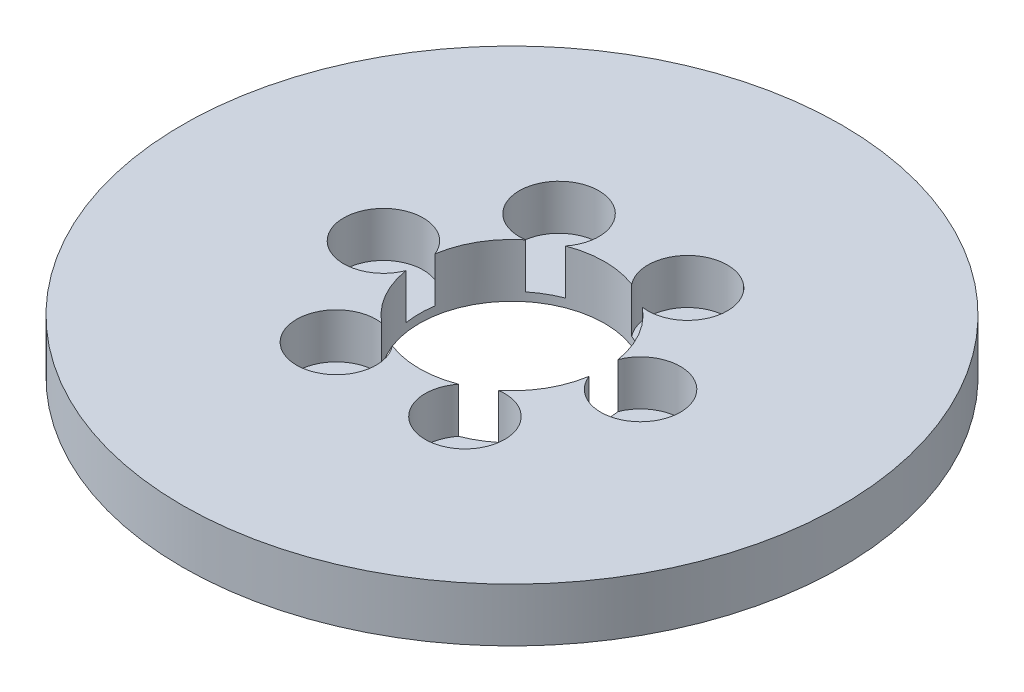
ISO-10303-21;
HEADER;
FILE_DESCRIPTION(('STEP AP214'),'2;1');
FILE_NAME('part.step','',(''),(''),'','','');
FILE_SCHEMA(('AUTOMOTIVE_DESIGN { 1 0 10303 214 1 1 1 1 }'));
ENDSEC;
DATA;
#1=APPLICATION_CONTEXT('core data for automotive mechanical design processes');
#2=APPLICATION_PROTOCOL_DEFINITION('international standard','automotive_design',2000,#1);
#3=PRODUCT_CONTEXT('',#1,'mechanical');
#4=PRODUCT('Part','Part','',(#3));
#5=PRODUCT_RELATED_PRODUCT_CATEGORY('part','',(#4));
#6=PRODUCT_DEFINITION_FORMATION('','',#4);
#7=PRODUCT_DEFINITION_CONTEXT('part definition',#1,'design');
#8=PRODUCT_DEFINITION('design','',#6,#7);
#9=PRODUCT_DEFINITION_SHAPE('','',#8);
#10=(LENGTH_UNIT() NAMED_UNIT(*) SI_UNIT(.MILLI.,.METRE.));
#11=(NAMED_UNIT(*) PLANE_ANGLE_UNIT() SI_UNIT($,.RADIAN.));
#12=(NAMED_UNIT(*) SI_UNIT($,.STERADIAN.) SOLID_ANGLE_UNIT());
#13=UNCERTAINTY_MEASURE_WITH_UNIT(LENGTH_MEASURE(1.E-05),#10,'distance_accuracy_value','');
#14=(GEOMETRIC_REPRESENTATION_CONTEXT(3) GLOBAL_UNCERTAINTY_ASSIGNED_CONTEXT((#13)) GLOBAL_UNIT_ASSIGNED_CONTEXT((#10,
#11,#12)) REPRESENTATION_CONTEXT('',''));
#15=CARTESIAN_POINT('',(0.,0.,0.));
#16=DIRECTION('',(0.,0.,1.));
#17=DIRECTION('',(1.,0.,0.));
#18=AXIS2_PLACEMENT_3D('',#15,#16,#17);
#19=CARTESIAN_POINT('',(0.,13.,0.));
#20=DIRECTION('',(0.,-1.,0.));
#21=DIRECTION('',(0.,0.,-1.));
#22=AXIS2_PLACEMENT_3D('',#19,#20,#21);
#23=CYLINDRICAL_SURFACE('',#22,80.);
#24=CARTESIAN_POINT('',(0.,13.,0.));
#25=DIRECTION('',(0.,1.,0.));
#26=DIRECTION('',(0.,0.,1.));
#27=AXIS2_PLACEMENT_3D('',#24,#25,#26);
#28=CIRCLE('',#27,80.);
#29=CARTESIAN_POINT('',(0.,13.,-80.));
#30=VERTEX_POINT('',#29);
#31=EDGE_CURVE('E171',#30,#30,#28,.T.);
#32=CARTESIAN_POINT('',(0.,0.,0.));
#33=DIRECTION('',(0.,1.,0.));
#34=DIRECTION('',(0.,0.,1.));
#35=AXIS2_PLACEMENT_3D('',#32,#33,#34);
#36=CIRCLE('',#35,80.);
#37=CARTESIAN_POINT('',(0.,0.,-80.));
#38=VERTEX_POINT('',#37);
#39=EDGE_CURVE('E157',#38,#38,#36,.T.);
#40=CARTESIAN_POINT('',(0.,13.,-80.));
#41=CARTESIAN_POINT('',(0.,12.8645833333333,-80.));
#42=CARTESIAN_POINT('',(0.,12.7291666666667,-80.));
#43=CARTESIAN_POINT('',(0.,12.4583333333333,-80.));
#44=CARTESIAN_POINT('',(0.,12.3229166666667,-80.));
#45=CARTESIAN_POINT('',(0.,12.0520833333333,-80.));
#46=CARTESIAN_POINT('',(0.,11.9166666666667,-80.));
#47=CARTESIAN_POINT('',(0.,11.6458333333333,-80.));
#48=CARTESIAN_POINT('',(0.,11.5104166666667,-80.));
#49=CARTESIAN_POINT('',(0.,11.2395833333333,-80.));
#50=CARTESIAN_POINT('',(0.,11.1041666666667,-80.));
#51=CARTESIAN_POINT('',(0.,10.8333333333333,-80.));
#52=CARTESIAN_POINT('',(0.,10.6979166666667,-80.));
#53=CARTESIAN_POINT('',(0.,10.4270833333333,-80.));
#54=CARTESIAN_POINT('',(0.,10.2916666666667,-80.));
#55=CARTESIAN_POINT('',(0.,10.0208333333333,-80.));
#56=CARTESIAN_POINT('',(0.,9.88541666666667,-80.));
#57=CARTESIAN_POINT('',(0.,9.61458333333333,-80.));
#58=CARTESIAN_POINT('',(0.,9.47916666666667,-80.));
#59=CARTESIAN_POINT('',(0.,9.20833333333333,-80.));
#60=CARTESIAN_POINT('',(0.,9.07291666666667,-80.));
#61=CARTESIAN_POINT('',(0.,8.80208333333333,-80.));
#62=CARTESIAN_POINT('',(0.,8.66666666666667,-80.));
#63=CARTESIAN_POINT('',(0.,8.39583333333333,-80.));
#64=CARTESIAN_POINT('',(0.,8.26041666666667,-80.));
#65=CARTESIAN_POINT('',(0.,7.98958333333333,-80.));
#66=CARTESIAN_POINT('',(0.,7.85416666666667,-80.));
#67=CARTESIAN_POINT('',(0.,7.58333333333333,-80.));
#68=CARTESIAN_POINT('',(0.,7.44791666666667,-80.));
#69=CARTESIAN_POINT('',(0.,7.17708333333333,-80.));
#70=CARTESIAN_POINT('',(0.,7.04166666666667,-80.));
#71=CARTESIAN_POINT('',(0.,6.77083333333333,-80.));
#72=CARTESIAN_POINT('',(0.,6.63541666666667,-80.));
#73=CARTESIAN_POINT('',(0.,6.36458333333333,-80.));
#74=CARTESIAN_POINT('',(0.,6.22916666666667,-80.));
#75=CARTESIAN_POINT('',(0.,5.95833333333333,-80.));
#76=CARTESIAN_POINT('',(0.,5.82291666666667,-80.));
#77=CARTESIAN_POINT('',(0.,5.55208333333333,-80.));
#78=CARTESIAN_POINT('',(0.,5.41666666666667,-80.));
#79=CARTESIAN_POINT('',(0.,5.14583333333333,-80.));
#80=CARTESIAN_POINT('',(0.,5.01041666666667,-80.));
#81=CARTESIAN_POINT('',(0.,4.73958333333333,-80.));
#82=CARTESIAN_POINT('',(0.,4.60416666666667,-80.));
#83=CARTESIAN_POINT('',(0.,4.33333333333333,-80.));
#84=CARTESIAN_POINT('',(0.,4.19791666666667,-80.));
#85=CARTESIAN_POINT('',(0.,3.92708333333333,-80.));
#86=CARTESIAN_POINT('',(0.,3.79166666666667,-80.));
#87=CARTESIAN_POINT('',(0.,3.52083333333333,-80.));
#88=CARTESIAN_POINT('',(0.,3.38541666666667,-80.));
#89=CARTESIAN_POINT('',(0.,3.11458333333333,-80.));
#90=CARTESIAN_POINT('',(0.,2.97916666666667,-80.));
#91=CARTESIAN_POINT('',(0.,2.70833333333333,-80.));
#92=CARTESIAN_POINT('',(0.,2.57291666666667,-80.));
#93=CARTESIAN_POINT('',(0.,2.30208333333333,-80.));
#94=CARTESIAN_POINT('',(0.,2.16666666666667,-80.));
#95=CARTESIAN_POINT('',(0.,1.89583333333333,-80.));
#96=CARTESIAN_POINT('',(0.,1.76041666666667,-80.));
#97=CARTESIAN_POINT('',(0.,1.48958333333333,-80.));
#98=CARTESIAN_POINT('',(0.,1.35416666666667,-80.));
#99=CARTESIAN_POINT('',(0.,1.08333333333333,-80.));
#100=CARTESIAN_POINT('',(0.,0.947916666666667,-80.));
#101=CARTESIAN_POINT('',(0.,0.677083333333334,-80.));
#102=CARTESIAN_POINT('',(0.,0.541666666666667,-80.));
#103=CARTESIAN_POINT('',(0.,0.270833333333334,-80.));
#104=CARTESIAN_POINT('',(0.,0.135416666666667,-80.));
#105=CARTESIAN_POINT('',(0.,0.,-80.));
#106=B_SPLINE_CURVE_WITH_KNOTS('',3,(#40,#41,#42,#43,#44,#45,#46,#47,#48,#49,#50,#51,#52,#53,
#54,#55,#56,#57,#58,#59,#60,#61,#62,#63,#64,#65,#66,#67,#68,#69,#70,#71,#72,#73,#74,#75,#76,#77,
#78,#79,#80,#81,#82,#83,#84,#85,#86,#87,#88,#89,#90,#91,#92,#93,#94,#95,#96,#97,#98,#99,#100,
#101,#102,#103,#104,#105),.UNSPECIFIED.,.F.,.F.,(4,2,2,2,2,2,2,2,2,2,2,2,2,2,2,2,2,2,2,2,2,2,2,
2,2,2,2,2,2,2,2,2,4),(0.,0.406249999999999,0.812499999999999,1.21875,1.625,2.03125,2.4375,
2.84375,3.25,3.65625,4.0625,4.46875,4.875,5.28125,5.6875,6.09375,6.5,6.90625,7.3125,7.71875,
8.125,8.53125,8.9375,9.34375,9.75,10.15625,10.5625,10.96875,11.375,11.78125,12.1875,12.59375,
13.),.UNSPECIFIED.);
#107=EDGE_CURVE('BSEAM39',#30,#38,#106,.T.);
#108=ORIENTED_EDGE('',*,*,#31,.F.);
#109=ORIENTED_EDGE('',*,*,#39,.T.);
#110=ORIENTED_EDGE('',*,*,#107,.T.);
#111=ORIENTED_EDGE('',*,*,#107,.F.);
#112=EDGE_LOOP('',(#108,#110,#109,#111));
#113=FACE_BOUND('',#112,.T.);
#114=ADVANCED_FACE('F39',(#113),#23,.T.);
#115=CARTESIAN_POINT('',(0.,13.,0.));
#116=DIRECTION('',(0.,1.,0.));
#117=DIRECTION('',(0.,0.,1.));
#118=AXIS2_PLACEMENT_3D('',#115,#116,#117);
#119=PLANE('',#118);
#120=CARTESIAN_POINT('',(-15.6050501604377,13.,-27.0287397325383));
#121=DIRECTION('',(0.,1.,0.));
#122=DIRECTION('',(-0.866025403784433,0.,0.50000000000001));
#123=AXIS2_PLACEMENT_3D('',#120,#121,#122);
#124=CIRCLE('',#123,9.65803549164258);
#125=CARTESIAN_POINT('',(-8.05176378163707,13.,-21.0099762019075));
#126=VERTEX_POINT('',#125);
#127=CARTESIAN_POINT('',(-14.1692912329402,13.,-17.4780200811226));
#128=VERTEX_POINT('',#127);
#129=EDGE_CURVE('E214',#126,#128,#124,.T.);
#130=ORIENTED_EDGE('',*,*,#129,.F.);
#131=CARTESIAN_POINT('',(0.,13.,0.));
#132=DIRECTION('',(0.,1.,0.));
#133=DIRECTION('',(0.,0.,1.));
#134=AXIS2_PLACEMENT_3D('',#131,#132,#133);
#135=CIRCLE('',#134,22.5);
#136=CARTESIAN_POINT('',(8.05176378163662,13.,-21.0099762019076));
#137=VERTEX_POINT('',#136);
#138=EDGE_CURVE('E272',#137,#126,#135,.T.);
#139=ORIENTED_EDGE('',*,*,#138,.F.);
#140=CARTESIAN_POINT('',(15.6050501604372,13.,-27.0287397325386));
#141=DIRECTION('',(0.,1.,0.));
#142=DIRECTION('',(-0.866025403784443,0.,-0.499999999999992));
#143=AXIS2_PLACEMENT_3D('',#140,#141,#142);
#144=CIRCLE('',#143,9.65803549164258);
#145=CARTESIAN_POINT('',(14.1692912329399,13.,-17.4780200811229));
#146=VERTEX_POINT('',#145);
#147=EDGE_CURVE('E285',#146,#137,#144,.T.);
#148=ORIENTED_EDGE('',*,*,#147,.F.);
#149=CARTESIAN_POINT('',(22.2210550145768,13.,-3.53195612078483));
#150=VERTEX_POINT('',#149);
#151=EDGE_CURVE('E165',#150,#146,#135,.T.);
#152=ORIENTED_EDGE('',*,*,#151,.F.);
#153=CARTESIAN_POINT('',(31.2101003208749,13.,0.));
#154=DIRECTION('',(0.,1.,0.));
#155=DIRECTION('',(0.,0.,-1.));
#156=AXIS2_PLACEMENT_3D('',#153,#154,#155);
#157=CIRCLE('',#156,9.65803549164258);
#158=CARTESIAN_POINT('',(22.2210550145768,13.,3.53195612078483));
#159=VERTEX_POINT('',#158);
#160=EDGE_CURVE('E281',#159,#150,#157,.T.);
#161=ORIENTED_EDGE('',*,*,#160,.F.);
#162=CARTESIAN_POINT('',(14.1692912329401,13.,17.4780200811227));
#163=VERTEX_POINT('',#162);
#164=EDGE_CURVE('E160',#163,#159,#135,.T.);
#165=ORIENTED_EDGE('',*,*,#164,.F.);
#166=CARTESIAN_POINT('',(15.6050501604376,13.,27.0287397325384));
#167=DIRECTION('',(0.,1.,0.));
#168=DIRECTION('',(0.866025403784436,0.,-0.500000000000004));
#169=AXIS2_PLACEMENT_3D('',#166,#167,#168);
#170=CIRCLE('',#169,9.65803549164258);
#171=CARTESIAN_POINT('',(8.05176378163693,13.,21.0099762019075));
#172=VERTEX_POINT('',#171);
#173=EDGE_CURVE('E154',#172,#163,#170,.T.);
#174=ORIENTED_EDGE('',*,*,#173,.F.);
#175=CARTESIAN_POINT('',(-8.05176378163678,13.,21.0099762019076));
#176=VERTEX_POINT('',#175);
#177=EDGE_CURVE('E150',#176,#172,#135,.T.);
#178=ORIENTED_EDGE('',*,*,#177,.F.);
#179=CARTESIAN_POINT('',(-15.6050501604374,13.,27.0287397325385));
#180=DIRECTION('',(0.,1.,0.));
#181=DIRECTION('',(0.86602540378444,0.,0.499999999999998));
#182=AXIS2_PLACEMENT_3D('',#179,#180,#181);
#183=CIRCLE('',#182,9.65803549164258);
#184=CARTESIAN_POINT('',(-14.16929123294,13.,17.4780200811228));
#185=VERTEX_POINT('',#184);
#186=EDGE_CURVE('E127',#185,#176,#183,.T.);
#187=ORIENTED_EDGE('',*,*,#186,.F.);
#188=CARTESIAN_POINT('',(-22.2210550145768,13.,3.53195612078483));
#189=VERTEX_POINT('',#188);
#190=EDGE_CURVE('E156',#189,#185,#135,.T.);
#191=ORIENTED_EDGE('',*,*,#190,.F.);
#192=CARTESIAN_POINT('',(-31.2101003208749,13.,0.));
#193=DIRECTION('',(0.,1.,0.));
#194=DIRECTION('',(0.,0.,1.));
#195=AXIS2_PLACEMENT_3D('',#192,#193,#194);
#196=CIRCLE('',#195,9.65803549164258);
#197=CARTESIAN_POINT('',(-22.2210550145768,13.,-3.53195612078483));
#198=VERTEX_POINT('',#197);
#199=EDGE_CURVE('E164',#198,#189,#196,.T.);
#200=ORIENTED_EDGE('',*,*,#199,.F.);
#201=EDGE_CURVE('E159',#128,#198,#135,.T.);
#202=ORIENTED_EDGE('',*,*,#201,.F.);
#203=EDGE_LOOP('',(#130,#139,#148,#152,#161,#165,#174,#178,#187,#191,#200,#202));
#204=FACE_BOUND('',#203,.T.);
#205=ORIENTED_EDGE('',*,*,#31,.T.);
#206=EDGE_LOOP('',(#205));
#207=FACE_BOUND('',#206,.T.);
#208=ADVANCED_FACE('F155',(#204,#207),#119,.T.);
#209=CARTESIAN_POINT('',(0.,0.,0.));
#210=DIRECTION('',(0.,1.,0.));
#211=DIRECTION('',(0.,0.,1.));
#212=AXIS2_PLACEMENT_3D('',#209,#210,#211);
#213=PLANE('',#212);
#214=CARTESIAN_POINT('',(0.,0.,0.));
#215=DIRECTION('',(0.,1.,0.));
#216=DIRECTION('',(0.,0.,1.));
#217=AXIS2_PLACEMENT_3D('',#214,#215,#216);
#218=CIRCLE('',#217,22.5);
#219=CARTESIAN_POINT('',(0.,0.,22.5));
#220=VERTEX_POINT('',#219);
#221=EDGE_CURVE('E170',#220,#220,#218,.T.);
#222=ORIENTED_EDGE('',*,*,#221,.T.);
#223=EDGE_LOOP('',(#222));
#224=FACE_BOUND('',#223,.T.);
#225=ORIENTED_EDGE('',*,*,#39,.F.);
#226=EDGE_LOOP('',(#225));
#227=FACE_BOUND('',#226,.T.);
#228=ADVANCED_FACE('F232',(#224,#227),#213,.F.);
#229=CARTESIAN_POINT('',(0.,13.,0.));
#230=DIRECTION('',(0.,-1.,0.));
#231=DIRECTION('',(0.,0.,-1.));
#232=AXIS2_PLACEMENT_3D('',#229,#230,#231);
#233=CYLINDRICAL_SURFACE('',#232,22.5);
#234=DIRECTION('',(0.,1.,0.));
#235=VECTOR('',#234,1.);
#236=CARTESIAN_POINT('',(-8.05176378163708,7.52507992945484,-21.0099762019074));
#237=LINE('',#236,#235);
#238=CARTESIAN_POINT('',(-8.05176378163707,2.05015985890967,-21.0099762019075));
#239=VERTEX_POINT('',#238);
#240=EDGE_CURVE('E11',#239,#126,#237,.T.);
#241=ORIENTED_EDGE('',*,*,#240,.F.);
#242=CARTESIAN_POINT('',(0.,2.05015985890967,0.));
#243=DIRECTION('',(0.,1.,0.));
#244=DIRECTION('',(0.,0.,1.));
#245=AXIS2_PLACEMENT_3D('',#242,#243,#244);
#246=CIRCLE('',#245,22.5);
#247=CARTESIAN_POINT('',(-14.1692912329402,2.05015985890967,-17.4780200811226));
#248=VERTEX_POINT('',#247);
#249=EDGE_CURVE('E209',#239,#248,#246,.T.);
#250=ORIENTED_EDGE('',*,*,#249,.T.);
#251=DIRECTION('',(0.,1.,0.));
#252=VECTOR('',#251,1.);
#253=CARTESIAN_POINT('',(-14.1692912329402,7.52507992945484,-17.4780200811226));
#254=LINE('',#253,#252);
#255=EDGE_CURVE('E46',#128,#248,#254,.F.);
#256=ORIENTED_EDGE('',*,*,#255,.F.);
#257=ORIENTED_EDGE('',*,*,#201,.T.);
#258=DIRECTION('',(0.,1.,0.));
#259=VECTOR('',#258,1.);
#260=CARTESIAN_POINT('',(-22.2210550145768,7.52507992945484,-3.53195612078482));
#261=LINE('',#260,#259);
#262=CARTESIAN_POINT('',(-22.2210550145768,2.05015985890967,-3.53195612078483));
#263=VERTEX_POINT('',#262);
#264=EDGE_CURVE('E185',#263,#198,#261,.T.);
#265=ORIENTED_EDGE('',*,*,#264,.F.);
#266=CARTESIAN_POINT('',(0.,2.05015985890967,0.));
#267=DIRECTION('',(0.,1.,0.));
#268=DIRECTION('',(0.,0.,1.));
#269=AXIS2_PLACEMENT_3D('',#266,#267,#268);
#270=CIRCLE('',#269,22.5);
#271=CARTESIAN_POINT('',(-22.2210550145768,2.05015985890967,3.53195612078483));
#272=VERTEX_POINT('',#271);
#273=EDGE_CURVE('E173',#263,#272,#270,.T.);
#274=ORIENTED_EDGE('',*,*,#273,.T.);
#275=DIRECTION('',(0.,1.,0.));
#276=VECTOR('',#275,1.);
#277=CARTESIAN_POINT('',(-22.2210550145768,7.52507992945484,3.53195612078482));
#278=LINE('',#277,#276);
#279=EDGE_CURVE('E178',#189,#272,#278,.F.);
#280=ORIENTED_EDGE('',*,*,#279,.F.);
#281=ORIENTED_EDGE('',*,*,#190,.T.);
#282=DIRECTION('',(0.,1.,0.));
#283=VECTOR('',#282,1.);
#284=CARTESIAN_POINT('',(-14.16929123294,7.52507992945484,17.4780200811228));
#285=LINE('',#284,#283);
#286=CARTESIAN_POINT('',(-14.16929123294,2.05015985890967,17.4780200811228));
#287=VERTEX_POINT('',#286);
#288=EDGE_CURVE('E132',#287,#185,#285,.T.);
#289=ORIENTED_EDGE('',*,*,#288,.F.);
#290=CARTESIAN_POINT('',(0.,2.05015985890967,0.));
#291=DIRECTION('',(0.,1.,0.));
#292=DIRECTION('',(0.,0.,1.));
#293=AXIS2_PLACEMENT_3D('',#290,#291,#292);
#294=CIRCLE('',#293,22.5);
#295=CARTESIAN_POINT('',(-8.05176378163678,2.05015985890967,21.0099762019076));
#296=VERTEX_POINT('',#295);
#297=EDGE_CURVE('E146',#287,#296,#294,.T.);
#298=ORIENTED_EDGE('',*,*,#297,.T.);
#299=DIRECTION('',(0.,1.,0.));
#300=VECTOR('',#299,1.);
#301=CARTESIAN_POINT('',(-8.05176378163678,7.52507992945484,21.0099762019076));
#302=LINE('',#301,#300);
#303=EDGE_CURVE('E128',#176,#296,#302,.F.);
#304=ORIENTED_EDGE('',*,*,#303,.F.);
#305=ORIENTED_EDGE('',*,*,#177,.T.);
#306=DIRECTION('',(0.,1.,0.));
#307=VECTOR('',#306,1.);
#308=CARTESIAN_POINT('',(8.05176378163693,7.52507992945484,21.0099762019075));
#309=LINE('',#308,#307);
#310=CARTESIAN_POINT('',(8.05176378163693,2.05015985890967,21.0099762019075));
#311=VERTEX_POINT('',#310);
#312=EDGE_CURVE('E192',#311,#172,#309,.T.);
#313=ORIENTED_EDGE('',*,*,#312,.F.);
#314=CARTESIAN_POINT('',(0.,2.05015985890967,0.));
#315=DIRECTION('',(0.,1.,0.));
#316=DIRECTION('',(0.,0.,1.));
#317=AXIS2_PLACEMENT_3D('',#314,#315,#316);
#318=CIRCLE('',#317,22.5);
#319=CARTESIAN_POINT('',(14.1692912329401,2.05015985890967,17.4780200811227));
#320=VERTEX_POINT('',#319);
#321=EDGE_CURVE('E190',#311,#320,#318,.T.);
#322=ORIENTED_EDGE('',*,*,#321,.T.);
#323=DIRECTION('',(0.,1.,0.));
#324=VECTOR('',#323,1.);
#325=CARTESIAN_POINT('',(14.1692912329401,7.52507992945484,17.4780200811227));
#326=LINE('',#325,#324);
#327=EDGE_CURVE('E189',#163,#320,#326,.F.);
#328=ORIENTED_EDGE('',*,*,#327,.F.);
#329=ORIENTED_EDGE('',*,*,#164,.T.);
#330=DIRECTION('',(0.,1.,0.));
#331=VECTOR('',#330,1.);
#332=CARTESIAN_POINT('',(22.2210550145768,7.52507992945484,3.53195612078482));
#333=LINE('',#332,#331);
#334=CARTESIAN_POINT('',(22.2210550145768,2.05015985890967,3.53195612078483));
#335=VERTEX_POINT('',#334);
#336=EDGE_CURVE('E203',#335,#159,#333,.T.);
#337=ORIENTED_EDGE('',*,*,#336,.F.);
#338=CARTESIAN_POINT('',(0.,2.05015985890967,0.));
#339=DIRECTION('',(0.,1.,0.));
#340=DIRECTION('',(0.,0.,1.));
#341=AXIS2_PLACEMENT_3D('',#338,#339,#340);
#342=CIRCLE('',#341,22.5);
#343=CARTESIAN_POINT('',(22.2210550145768,2.05015985890967,-3.53195612078483));
#344=VERTEX_POINT('',#343);
#345=EDGE_CURVE('E194',#335,#344,#342,.T.);
#346=ORIENTED_EDGE('',*,*,#345,.T.);
#347=DIRECTION('',(0.,1.,0.));
#348=VECTOR('',#347,1.);
#349=CARTESIAN_POINT('',(22.2210550145768,7.52507992945484,-3.53195612078482));
#350=LINE('',#349,#348);
#351=EDGE_CURVE('E196',#150,#344,#350,.F.);
#352=ORIENTED_EDGE('',*,*,#351,.F.);
#353=ORIENTED_EDGE('',*,*,#151,.T.);
#354=DIRECTION('',(0.,1.,0.));
#355=VECTOR('',#354,1.);
#356=CARTESIAN_POINT('',(14.1692912329399,7.52507992945484,-17.4780200811229));
#357=LINE('',#356,#355);
#358=CARTESIAN_POINT('',(14.1692912329399,2.05015985890967,-17.4780200811229));
#359=VERTEX_POINT('',#358);
#360=EDGE_CURVE('E208',#359,#146,#357,.T.);
#361=ORIENTED_EDGE('',*,*,#360,.F.);
#362=CARTESIAN_POINT('',(0.,2.05015985890967,0.));
#363=DIRECTION('',(0.,1.,0.));
#364=DIRECTION('',(0.,0.,1.));
#365=AXIS2_PLACEMENT_3D('',#362,#363,#364);
#366=CIRCLE('',#365,22.5);
#367=CARTESIAN_POINT('',(8.05176378163662,2.05015985890967,-21.0099762019076));
#368=VERTEX_POINT('',#367);
#369=EDGE_CURVE('E201',#359,#368,#366,.T.);
#370=ORIENTED_EDGE('',*,*,#369,.T.);
#371=DIRECTION('',(0.,1.,0.));
#372=VECTOR('',#371,1.);
#373=CARTESIAN_POINT('',(8.05176378163663,7.52507992945484,-21.0099762019076));
#374=LINE('',#373,#372);
#375=EDGE_CURVE('E206',#137,#368,#374,.F.);
#376=ORIENTED_EDGE('',*,*,#375,.F.);
#377=ORIENTED_EDGE('',*,*,#138,.T.);
#378=EDGE_LOOP('',(#241,#250,#256,#257,#265,#274,#280,#281,#289,#298,#304,#305,#313,#322,#328,
#329,#337,#346,#352,#353,#361,#370,#376,#377));
#379=FACE_BOUND('',#378,.T.);
#380=ORIENTED_EDGE('',*,*,#221,.F.);
#381=EDGE_LOOP('',(#380));
#382=FACE_BOUND('',#381,.T.);
#383=ADVANCED_FACE('F145',(#379,#382),#233,.F.);
#384=CARTESIAN_POINT('',(-31.2101003208749,2.05015985890967,0.));
#385=DIRECTION('',(0.,1.,0.));
#386=DIRECTION('',(0.,0.,1.));
#387=AXIS2_PLACEMENT_3D('',#384,#385,#386);
#388=CYLINDRICAL_SURFACE('',#387,9.65803549164258);
#389=ORIENTED_EDGE('',*,*,#264,.T.);
#390=ORIENTED_EDGE('',*,*,#199,.T.);
#391=ORIENTED_EDGE('',*,*,#279,.T.);
#392=CARTESIAN_POINT('',(-31.2101003208749,2.05015985890967,0.));
#393=DIRECTION('',(0.,1.,0.));
#394=DIRECTION('',(0.,0.,1.));
#395=AXIS2_PLACEMENT_3D('',#392,#393,#394);
#396=CIRCLE('',#395,9.65803549164258);
#397=EDGE_CURVE('E168',#263,#272,#396,.T.);
#398=ORIENTED_EDGE('',*,*,#397,.F.);
#399=EDGE_LOOP('',(#389,#390,#391,#398));
#400=FACE_BOUND('',#399,.T.);
#401=ADVANCED_FACE('F243',(#400),#388,.F.);
#402=CARTESIAN_POINT('',(-31.2101003208749,2.05015985890967,0.));
#403=DIRECTION('',(0.,1.,0.));
#404=DIRECTION('',(0.,0.,1.));
#405=AXIS2_PLACEMENT_3D('',#402,#403,#404);
#406=PLANE('',#405);
#407=ORIENTED_EDGE('',*,*,#397,.T.);
#408=ORIENTED_EDGE('',*,*,#273,.F.);
#409=EDGE_LOOP('',(#407,#408));
#410=FACE_BOUND('',#409,.T.);
#411=ADVANCED_FACE('F247',(#410),#406,.T.);
#412=CARTESIAN_POINT('',(-15.6050501604374,2.05015985890967,27.0287397325385));
#413=DIRECTION('',(0.,1.,0.));
#414=DIRECTION('',(0.,0.,1.));
#415=AXIS2_PLACEMENT_3D('',#412,#413,#414);
#416=CYLINDRICAL_SURFACE('',#415,9.65803549164258);
#417=ORIENTED_EDGE('',*,*,#288,.T.);
#418=ORIENTED_EDGE('',*,*,#186,.T.);
#419=ORIENTED_EDGE('',*,*,#303,.T.);
#420=CARTESIAN_POINT('',(-15.6050501604374,2.05015985890967,27.0287397325385));
#421=DIRECTION('',(0.,1.,0.));
#422=DIRECTION('',(0.86602540378444,0.,0.499999999999998));
#423=AXIS2_PLACEMENT_3D('',#420,#421,#422);
#424=CIRCLE('',#423,9.65803549164258);
#425=EDGE_CURVE('E137',#287,#296,#424,.T.);
#426=ORIENTED_EDGE('',*,*,#425,.F.);
#427=EDGE_LOOP('',(#417,#418,#419,#426));
#428=FACE_BOUND('',#427,.T.);
#429=ADVANCED_FACE('F126',(#428),#416,.F.);
#430=CARTESIAN_POINT('',(-15.6050501604374,2.05015985890967,27.0287397325385));
#431=DIRECTION('',(0.,1.,0.));
#432=DIRECTION('',(0.86602540378444,0.,0.499999999999998));
#433=AXIS2_PLACEMENT_3D('',#430,#431,#432);
#434=PLANE('',#433);
#435=ORIENTED_EDGE('',*,*,#425,.T.);
#436=ORIENTED_EDGE('',*,*,#297,.F.);
#437=EDGE_LOOP('',(#435,#436));
#438=FACE_BOUND('',#437,.T.);
#439=ADVANCED_FACE('F254',(#438),#434,.T.);
#440=CARTESIAN_POINT('',(15.6050501604376,2.05015985890967,27.0287397325384));
#441=DIRECTION('',(0.,1.,0.));
#442=DIRECTION('',(0.,0.,1.));
#443=AXIS2_PLACEMENT_3D('',#440,#441,#442);
#444=CYLINDRICAL_SURFACE('',#443,9.65803549164258);
#445=ORIENTED_EDGE('',*,*,#312,.T.);
#446=ORIENTED_EDGE('',*,*,#173,.T.);
#447=ORIENTED_EDGE('',*,*,#327,.T.);
#448=CARTESIAN_POINT('',(15.6050501604376,2.05015985890967,27.0287397325384));
#449=DIRECTION('',(0.,1.,0.));
#450=DIRECTION('',(0.866025403784436,0.,-0.500000000000004));
#451=AXIS2_PLACEMENT_3D('',#448,#449,#450);
#452=CIRCLE('',#451,9.65803549164258);
#453=EDGE_CURVE('E138',#311,#320,#452,.T.);
#454=ORIENTED_EDGE('',*,*,#453,.F.);
#455=EDGE_LOOP('',(#445,#446,#447,#454));
#456=FACE_BOUND('',#455,.T.);
#457=ADVANCED_FACE('F260',(#456),#444,.F.);
#458=CARTESIAN_POINT('',(15.6050501604376,2.05015985890967,27.0287397325384));
#459=DIRECTION('',(0.,1.,0.));
#460=DIRECTION('',(0.866025403784436,0.,-0.500000000000004));
#461=AXIS2_PLACEMENT_3D('',#458,#459,#460);
#462=PLANE('',#461);
#463=ORIENTED_EDGE('',*,*,#453,.T.);
#464=ORIENTED_EDGE('',*,*,#321,.F.);
#465=EDGE_LOOP('',(#463,#464));
#466=FACE_BOUND('',#465,.T.);
#467=ADVANCED_FACE('F265',(#466),#462,.T.);
#468=CARTESIAN_POINT('',(31.2101003208749,2.05015985890967,0.));
#469=DIRECTION('',(0.,1.,0.));
#470=DIRECTION('',(0.,0.,1.));
#471=AXIS2_PLACEMENT_3D('',#468,#469,#470);
#472=CYLINDRICAL_SURFACE('',#471,9.65803549164258);
#473=ORIENTED_EDGE('',*,*,#336,.T.);
#474=ORIENTED_EDGE('',*,*,#160,.T.);
#475=ORIENTED_EDGE('',*,*,#351,.T.);
#476=CARTESIAN_POINT('',(31.2101003208749,2.05015985890967,0.));
#477=DIRECTION('',(0.,1.,0.));
#478=DIRECTION('',(0.,0.,-1.));
#479=AXIS2_PLACEMENT_3D('',#476,#477,#478);
#480=CIRCLE('',#479,9.65803549164258);
#481=EDGE_CURVE('E287',#335,#344,#480,.T.);
#482=ORIENTED_EDGE('',*,*,#481,.F.);
#483=EDGE_LOOP('',(#473,#474,#475,#482));
#484=FACE_BOUND('',#483,.T.);
#485=ADVANCED_FACE('F300',(#484),#472,.F.);
#486=CARTESIAN_POINT('',(31.2101003208749,2.05015985890967,0.));
#487=DIRECTION('',(0.,1.,0.));
#488=DIRECTION('',(0.,0.,-1.));
#489=AXIS2_PLACEMENT_3D('',#486,#487,#488);
#490=PLANE('',#489);
#491=ORIENTED_EDGE('',*,*,#481,.T.);
#492=ORIENTED_EDGE('',*,*,#345,.F.);
#493=EDGE_LOOP('',(#491,#492));
#494=FACE_BOUND('',#493,.T.);
#495=ADVANCED_FACE('F298',(#494),#490,.T.);
#496=CARTESIAN_POINT('',(15.6050501604372,2.05015985890967,-27.0287397325386));
#497=DIRECTION('',(0.,1.,0.));
#498=DIRECTION('',(0.,0.,1.));
#499=AXIS2_PLACEMENT_3D('',#496,#497,#498);
#500=CYLINDRICAL_SURFACE('',#499,9.65803549164258);
#501=ORIENTED_EDGE('',*,*,#360,.T.);
#502=ORIENTED_EDGE('',*,*,#147,.T.);
#503=ORIENTED_EDGE('',*,*,#375,.T.);
#504=CARTESIAN_POINT('',(15.6050501604372,2.05015985890967,-27.0287397325386));
#505=DIRECTION('',(0.,1.,0.));
#506=DIRECTION('',(-0.866025403784443,0.,-0.499999999999992));
#507=AXIS2_PLACEMENT_3D('',#504,#505,#506);
#508=CIRCLE('',#507,9.65803549164258);
#509=EDGE_CURVE('E56',#359,#368,#508,.T.);
#510=ORIENTED_EDGE('',*,*,#509,.F.);
#511=EDGE_LOOP('',(#501,#502,#503,#510));
#512=FACE_BOUND('',#511,.T.);
#513=ADVANCED_FACE('F301',(#512),#500,.F.);
#514=CARTESIAN_POINT('',(15.6050501604372,2.05015985890967,-27.0287397325386));
#515=DIRECTION('',(0.,1.,0.));
#516=DIRECTION('',(-0.866025403784443,0.,-0.499999999999992));
#517=AXIS2_PLACEMENT_3D('',#514,#515,#516);
#518=PLANE('',#517);
#519=ORIENTED_EDGE('',*,*,#509,.T.);
#520=ORIENTED_EDGE('',*,*,#369,.F.);
#521=EDGE_LOOP('',(#519,#520));
#522=FACE_BOUND('',#521,.T.);
#523=ADVANCED_FACE('F221',(#522),#518,.T.);
#524=CARTESIAN_POINT('',(-15.6050501604377,2.05015985890967,-27.0287397325383));
#525=DIRECTION('',(0.,1.,0.));
#526=DIRECTION('',(0.,0.,1.));
#527=AXIS2_PLACEMENT_3D('',#524,#525,#526);
#528=CYLINDRICAL_SURFACE('',#527,9.65803549164258);
#529=ORIENTED_EDGE('',*,*,#240,.T.);
#530=ORIENTED_EDGE('',*,*,#129,.T.);
#531=ORIENTED_EDGE('',*,*,#255,.T.);
#532=CARTESIAN_POINT('',(-15.6050501604377,2.05015985890967,-27.0287397325383));
#533=DIRECTION('',(0.,1.,0.));
#534=DIRECTION('',(-0.866025403784433,0.,0.50000000000001));
#535=AXIS2_PLACEMENT_3D('',#532,#533,#534);
#536=CIRCLE('',#535,9.65803549164258);
#537=EDGE_CURVE('E55',#239,#248,#536,.T.);
#538=ORIENTED_EDGE('',*,*,#537,.F.);
#539=EDGE_LOOP('',(#529,#530,#531,#538));
#540=FACE_BOUND('',#539,.T.);
#541=ADVANCED_FACE('F212',(#540),#528,.F.);
#542=CARTESIAN_POINT('',(-15.6050501604377,2.05015985890967,-27.0287397325383));
#543=DIRECTION('',(0.,1.,0.));
#544=DIRECTION('',(-0.866025403784433,0.,0.50000000000001));
#545=AXIS2_PLACEMENT_3D('',#542,#543,#544);
#546=PLANE('',#545);
#547=ORIENTED_EDGE('',*,*,#537,.T.);
#548=ORIENTED_EDGE('',*,*,#249,.F.);
#549=EDGE_LOOP('',(#547,#548));
#550=FACE_BOUND('',#549,.T.);
#551=ADVANCED_FACE('F217',(#550),#546,.T.);
#552=CLOSED_SHELL('',(#114,#208,#228,#383,#401,#411,#429,#439,#457,#467,#485,#495,#513,#523,
#541,#551));
#553=MANIFOLD_SOLID_BREP('B2',#552);
#554=ADVANCED_BREP_SHAPE_REPRESENTATION('',(#18,#553),#14);
#555=SHAPE_DEFINITION_REPRESENTATION(#9,#554);
ENDSEC;
END-ISO-10303-21;
